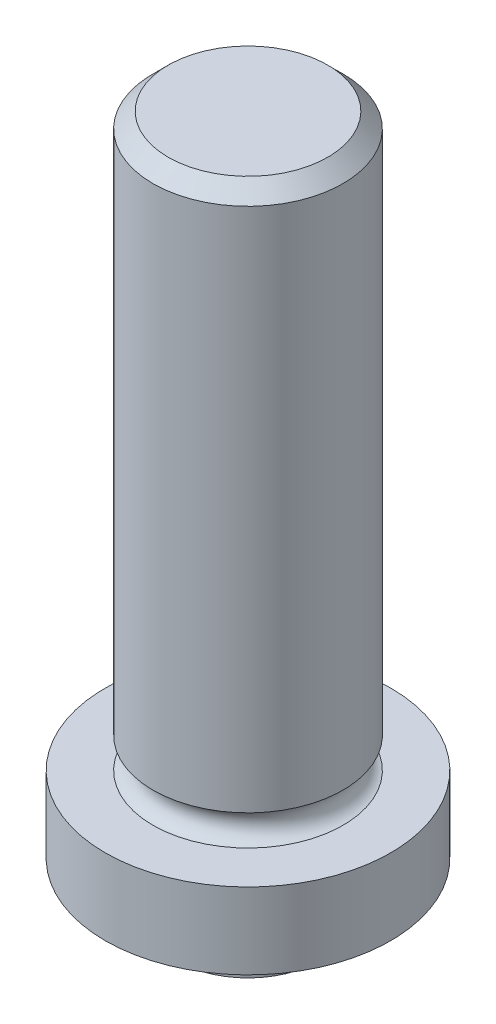
ISO-10303-21;
HEADER;
FILE_DESCRIPTION(('STEP AP214'),'2;1');
FILE_NAME('part.step','',(''),(''),'','','');
FILE_SCHEMA(('AUTOMOTIVE_DESIGN { 1 0 10303 214 1 1 1 1 }'));
ENDSEC;
DATA;
#1=APPLICATION_CONTEXT('core data for automotive mechanical design processes');
#2=APPLICATION_PROTOCOL_DEFINITION('international standard','automotive_design',2000,#1);
#3=PRODUCT_CONTEXT('',#1,'mechanical');
#4=PRODUCT('Part','Part','',(#3));
#5=PRODUCT_RELATED_PRODUCT_CATEGORY('part','',(#4));
#6=PRODUCT_DEFINITION_FORMATION('','',#4);
#7=PRODUCT_DEFINITION_CONTEXT('part definition',#1,'design');
#8=PRODUCT_DEFINITION('design','',#6,#7);
#9=PRODUCT_DEFINITION_SHAPE('','',#8);
#10=(LENGTH_UNIT() NAMED_UNIT(*) SI_UNIT(.MILLI.,.METRE.));
#11=(NAMED_UNIT(*) PLANE_ANGLE_UNIT() SI_UNIT($,.RADIAN.));
#12=(NAMED_UNIT(*) SI_UNIT($,.STERADIAN.) SOLID_ANGLE_UNIT());
#13=UNCERTAINTY_MEASURE_WITH_UNIT(LENGTH_MEASURE(1.E-05),#10,'distance_accuracy_value','');
#14=(GEOMETRIC_REPRESENTATION_CONTEXT(3) GLOBAL_UNCERTAINTY_ASSIGNED_CONTEXT((#13)) GLOBAL_UNIT_ASSIGNED_CONTEXT((#10,
#11,#12)) REPRESENTATION_CONTEXT('',''));
#15=CARTESIAN_POINT('',(0.,0.,0.));
#16=DIRECTION('',(0.,0.,1.));
#17=DIRECTION('',(1.,0.,0.));
#18=AXIS2_PLACEMENT_3D('',#15,#16,#17);
#19=CARTESIAN_POINT('',(2.3749,0.,0.));
#20=DIRECTION('',(0.,-1.,0.));
#21=DIRECTION('',(0.,0.,-1.));
#22=AXIS2_PLACEMENT_3D('',#19,#20,#21);
#23=PLANE('',#22);
#24=CARTESIAN_POINT('',(0.,0.,0.));
#25=DIRECTION('',(0.,-1.,0.));
#26=DIRECTION('',(0.,0.,-1.));
#27=AXIS2_PLACEMENT_3D('',#24,#25,#26);
#28=CIRCLE('',#27,2.3749);
#29=CARTESIAN_POINT('',(0.,0.,-2.3749));
#30=VERTEX_POINT('',#29);
#31=EDGE_CURVE('E60',#30,#30,#28,.T.);
#32=ORIENTED_EDGE('',*,*,#31,.T.);
#33=EDGE_LOOP('',(#32));
#34=FACE_BOUND('',#33,.T.);
#35=ADVANCED_FACE('F34',(#34),#23,.T.);
#36=CARTESIAN_POINT('',(0.,0.,0.));
#37=DIRECTION('',(0.,-1.,0.));
#38=DIRECTION('',(0.,0.,-1.));
#39=AXIS2_PLACEMENT_3D('',#36,#37,#38);
#40=CYLINDRICAL_SURFACE('',#39,2.3749);
#41=CARTESIAN_POINT('',(0.,1.651,0.));
#42=DIRECTION('',(0.,-1.,0.));
#43=DIRECTION('',(0.,0.,-1.));
#44=AXIS2_PLACEMENT_3D('',#41,#42,#43);
#45=CIRCLE('',#44,2.3749);
#46=CARTESIAN_POINT('',(0.,1.651,-2.3749));
#47=VERTEX_POINT('',#46);
#48=EDGE_CURVE('E54',#47,#47,#45,.T.);
#49=ORIENTED_EDGE('',*,*,#48,.T.);
#50=EDGE_LOOP('',(#49));
#51=FACE_BOUND('',#50,.T.);
#52=ORIENTED_EDGE('',*,*,#31,.F.);
#53=EDGE_LOOP('',(#52));
#54=FACE_BOUND('',#53,.T.);
#55=ADVANCED_FACE('F94',(#51,#54),#40,.T.);
#56=CARTESIAN_POINT('',(4.7625,1.778,0.));
#57=DIRECTION('',(0.,-1.,0.));
#58=DIRECTION('',(0.,0.,-1.));
#59=AXIS2_PLACEMENT_3D('',#56,#57,#58);
#60=PLANE('',#59);
#61=CARTESIAN_POINT('',(0.,1.778,0.));
#62=DIRECTION('',(0.,-1.,0.));
#63=DIRECTION('',(0.,0.,-1.));
#64=AXIS2_PLACEMENT_3D('',#61,#62,#63);
#65=CIRCLE('',#64,2.5019);
#66=CARTESIAN_POINT('',(0.,1.778,-2.5019));
#67=VERTEX_POINT('',#66);
#68=EDGE_CURVE('E48',#67,#67,#65,.F.);
#69=ORIENTED_EDGE('',*,*,#68,.T.);
#70=EDGE_LOOP('',(#69));
#71=FACE_BOUND('',#70,.T.);
#72=CARTESIAN_POINT('',(0.,1.778,0.));
#73=DIRECTION('',(0.,-1.,0.));
#74=DIRECTION('',(0.,0.,-1.));
#75=AXIS2_PLACEMENT_3D('',#72,#73,#74);
#76=CIRCLE('',#75,4.7625);
#77=CARTESIAN_POINT('',(0.,1.778,-4.7625));
#78=VERTEX_POINT('',#77);
#79=EDGE_CURVE('E64',#78,#78,#76,.T.);
#80=ORIENTED_EDGE('',*,*,#79,.T.);
#81=EDGE_LOOP('',(#80));
#82=FACE_BOUND('',#81,.T.);
#83=ADVANCED_FACE('F99',(#71,#82),#60,.T.);
#84=CARTESIAN_POINT('',(0.,0.,0.));
#85=DIRECTION('',(0.,-1.,0.));
#86=DIRECTION('',(0.,0.,-1.));
#87=AXIS2_PLACEMENT_3D('',#84,#85,#86);
#88=CYLINDRICAL_SURFACE('',#87,4.7625);
#89=CARTESIAN_POINT('',(0.,4.318,0.));
#90=DIRECTION('',(0.,-1.,0.));
#91=DIRECTION('',(0.,0.,-1.));
#92=AXIS2_PLACEMENT_3D('',#89,#90,#91);
#93=CIRCLE('',#92,4.7625);
#94=CARTESIAN_POINT('',(0.,4.318,-4.7625));
#95=VERTEX_POINT('',#94);
#96=EDGE_CURVE('E67',#95,#95,#93,.T.);
#97=ORIENTED_EDGE('',*,*,#96,.T.);
#98=EDGE_LOOP('',(#97));
#99=FACE_BOUND('',#98,.T.);
#100=ORIENTED_EDGE('',*,*,#79,.F.);
#101=EDGE_LOOP('',(#100));
#102=FACE_BOUND('',#101,.T.);
#103=ADVANCED_FACE('F106',(#99,#102),#88,.T.);
#104=CARTESIAN_POINT('',(3.17119,4.318,0.));
#105=DIRECTION('',(0.,1.,0.));
#106=DIRECTION('',(0.,0.,1.));
#107=AXIS2_PLACEMENT_3D('',#104,#105,#106);
#108=PLANE('',#107);
#109=CARTESIAN_POINT('',(0.,4.318,0.));
#110=DIRECTION('',(0.,-1.,0.));
#111=DIRECTION('',(0.,0.,-1.));
#112=AXIS2_PLACEMENT_3D('',#109,#110,#111);
#113=CIRCLE('',#112,3.17119);
#114=CARTESIAN_POINT('',(0.,4.318,-3.17119));
#115=VERTEX_POINT('',#114);
#116=EDGE_CURVE('E70',#115,#115,#113,.T.);
#117=ORIENTED_EDGE('',*,*,#116,.T.);
#118=EDGE_LOOP('',(#117));
#119=FACE_BOUND('',#118,.T.);
#120=ORIENTED_EDGE('',*,*,#96,.F.);
#121=EDGE_LOOP('',(#120));
#122=FACE_BOUND('',#121,.T.);
#123=ADVANCED_FACE('F91',(#119,#122),#108,.T.);
#124=CARTESIAN_POINT('',(0.,4.826,0.));
#125=DIRECTION('',(0.,-1.,0.));
#126=DIRECTION('',(0.,0.,-1.));
#127=AXIS2_PLACEMENT_3D('',#124,#125,#126);
#128=TOROIDAL_SURFACE('',#127,3.29819,0.523634414453441);
#129=CARTESIAN_POINT('',(0.,5.334,0.));
#130=DIRECTION('',(0.,-1.,0.));
#131=DIRECTION('',(0.,0.,-1.));
#132=AXIS2_PLACEMENT_3D('',#129,#130,#131);
#133=CIRCLE('',#132,3.17119);
#134=CARTESIAN_POINT('',(0.,5.334,-3.17119));
#135=VERTEX_POINT('',#134);
#136=EDGE_CURVE('E73',#135,#135,#133,.T.);
#137=ORIENTED_EDGE('',*,*,#136,.T.);
#138=EDGE_LOOP('',(#137));
#139=FACE_BOUND('',#138,.T.);
#140=ORIENTED_EDGE('',*,*,#116,.F.);
#141=EDGE_LOOP('',(#140));
#142=FACE_BOUND('',#141,.T.);
#143=ADVANCED_FACE('F78',(#139,#142),#128,.F.);
#144=CARTESIAN_POINT('',(0.,0.,0.));
#145=DIRECTION('',(0.,-1.,0.));
#146=DIRECTION('',(0.,0.,-1.));
#147=AXIS2_PLACEMENT_3D('',#144,#145,#146);
#148=CYLINDRICAL_SURFACE('',#147,3.17119000000001);
#149=CARTESIAN_POINT('',(0.,22.86,0.));
#150=DIRECTION('',(0.,1.,0.));
#151=DIRECTION('',(0.,0.,1.));
#152=AXIS2_PLACEMENT_3D('',#149,#150,#151);
#153=CIRCLE('',#152,3.17119000000001);
#154=CARTESIAN_POINT('',(0.,22.86,3.17119000000001));
#155=VERTEX_POINT('',#154);
#156=EDGE_CURVE('E41',#155,#155,#153,.F.);
#157=ORIENTED_EDGE('',*,*,#156,.T.);
#158=EDGE_LOOP('',(#157));
#159=FACE_BOUND('',#158,.T.);
#160=ORIENTED_EDGE('',*,*,#136,.F.);
#161=EDGE_LOOP('',(#160));
#162=FACE_BOUND('',#161,.T.);
#163=ADVANCED_FACE('F81',(#159,#162),#148,.T.);
#164=CARTESIAN_POINT('',(0.,23.368,0.));
#165=DIRECTION('',(0.,1.,0.));
#166=DIRECTION('',(0.,0.,1.));
#167=AXIS2_PLACEMENT_3D('',#164,#165,#166);
#168=PLANE('',#167);
#169=CARTESIAN_POINT('',(0.,23.368,0.));
#170=DIRECTION('',(0.,1.,0.));
#171=DIRECTION('',(0.,0.,1.));
#172=AXIS2_PLACEMENT_3D('',#169,#170,#171);
#173=CIRCLE('',#172,2.66319);
#174=CARTESIAN_POINT('',(0.,23.368,2.66319));
#175=VERTEX_POINT('',#174);
#176=EDGE_CURVE('E10',#175,#175,#173,.T.);
#177=ORIENTED_EDGE('',*,*,#176,.T.);
#178=EDGE_LOOP('',(#177));
#179=FACE_BOUND('',#178,.T.);
#180=ADVANCED_FACE('F83',(#179),#168,.T.);
#181=CARTESIAN_POINT('',(0.,1.651,0.));
#182=DIRECTION('',(0.,-1.,0.));
#183=DIRECTION('',(0.,0.,-1.));
#184=AXIS2_PLACEMENT_3D('',#181,#182,#183);
#185=TOROIDAL_SURFACE('',#184,2.5019,0.127);
#186=ORIENTED_EDGE('',*,*,#68,.F.);
#187=EDGE_LOOP('',(#186));
#188=FACE_BOUND('',#187,.T.);
#189=ORIENTED_EDGE('',*,*,#48,.F.);
#190=EDGE_LOOP('',(#189));
#191=FACE_BOUND('',#190,.T.);
#192=ADVANCED_FACE('F89',(#188,#191),#185,.F.);
#193=CARTESIAN_POINT('',(0.,22.86,0.));
#194=DIRECTION('',(0.,-1.,0.));
#195=DIRECTION('',(0.,0.,-1.));
#196=AXIS2_PLACEMENT_3D('',#193,#194,#195);
#197=CONICAL_SURFACE('',#196,3.17119000000001,0.785398163397449);
#198=ORIENTED_EDGE('',*,*,#176,.F.);
#199=EDGE_LOOP('',(#198));
#200=FACE_BOUND('',#199,.T.);
#201=ORIENTED_EDGE('',*,*,#156,.F.);
#202=EDGE_LOOP('',(#201));
#203=FACE_BOUND('',#202,.T.);
#204=ADVANCED_FACE('F145',(#200,#203),#197,.T.);
#205=CLOSED_SHELL('',(#35,#55,#83,#103,#123,#143,#163,#180,#192,#204));
#206=MANIFOLD_SOLID_BREP('B2',#205);
#207=ADVANCED_BREP_SHAPE_REPRESENTATION('',(#18,#206),#14);
#208=SHAPE_DEFINITION_REPRESENTATION(#9,#207);
ENDSEC;
END-ISO-10303-21;
